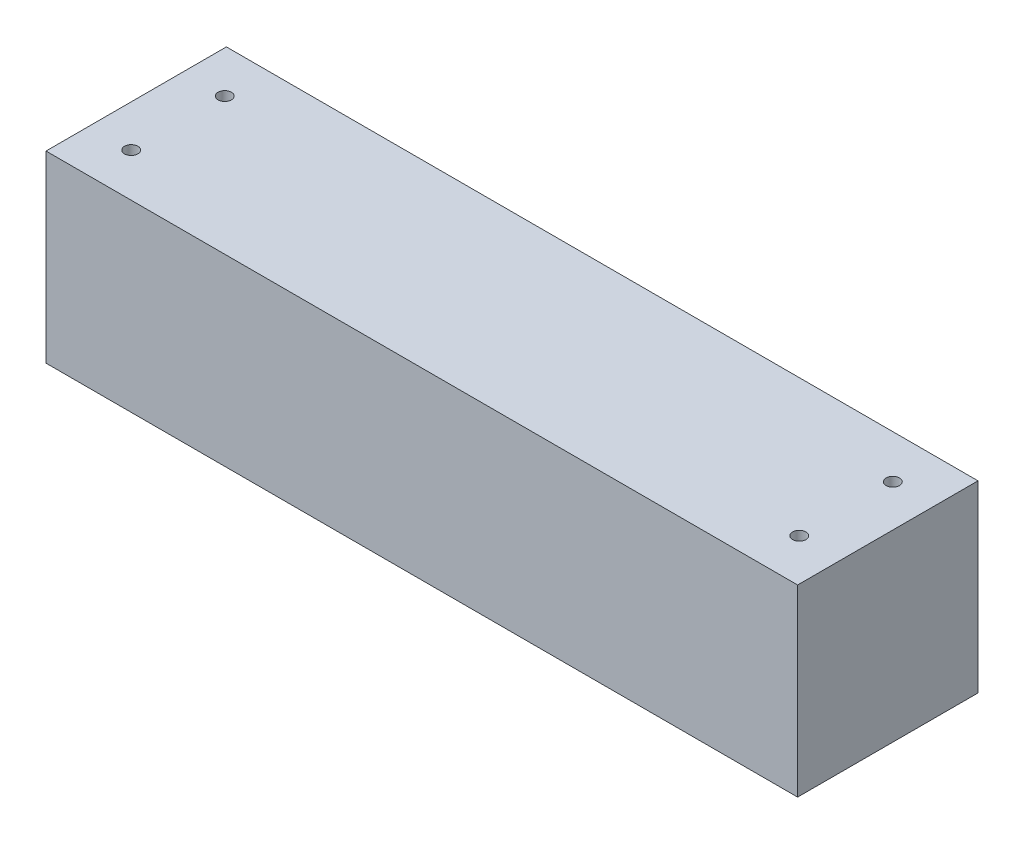
ISO-10303-21;
HEADER;
FILE_DESCRIPTION(('STEP AP214'),'2;1');
FILE_NAME('part.step','',(''),(''),'','','');
FILE_SCHEMA(('AUTOMOTIVE_DESIGN { 1 0 10303 214 1 1 1 1 }'));
ENDSEC;
DATA;
#1=APPLICATION_CONTEXT('core data for automotive mechanical design processes');
#2=APPLICATION_PROTOCOL_DEFINITION('international standard','automotive_design',2000,#1);
#3=PRODUCT_CONTEXT('',#1,'mechanical');
#4=PRODUCT('Part','Part','',(#3));
#5=PRODUCT_RELATED_PRODUCT_CATEGORY('part','',(#4));
#6=PRODUCT_DEFINITION_FORMATION('','',#4);
#7=PRODUCT_DEFINITION_CONTEXT('part definition',#1,'design');
#8=PRODUCT_DEFINITION('design','',#6,#7);
#9=PRODUCT_DEFINITION_SHAPE('','',#8);
#10=(LENGTH_UNIT() NAMED_UNIT(*) SI_UNIT(.MILLI.,.METRE.));
#11=(NAMED_UNIT(*) PLANE_ANGLE_UNIT() SI_UNIT($,.RADIAN.));
#12=(NAMED_UNIT(*) SI_UNIT($,.STERADIAN.) SOLID_ANGLE_UNIT());
#13=UNCERTAINTY_MEASURE_WITH_UNIT(LENGTH_MEASURE(1.E-05),#10,'distance_accuracy_value','');
#14=(GEOMETRIC_REPRESENTATION_CONTEXT(3) GLOBAL_UNCERTAINTY_ASSIGNED_CONTEXT((#13)) GLOBAL_UNIT_ASSIGNED_CONTEXT((#10,
#11,#12)) REPRESENTATION_CONTEXT('',''));
#15=CARTESIAN_POINT('',(0.,0.,0.));
#16=DIRECTION('',(0.,0.,1.));
#17=DIRECTION('',(1.,0.,0.));
#18=AXIS2_PLACEMENT_3D('',#15,#16,#17);
#19=CARTESIAN_POINT('',(0.,0.,54.));
#20=DIRECTION('',(1.,0.,0.));
#21=DIRECTION('',(0.,1.,0.));
#22=AXIS2_PLACEMENT_3D('',#19,#20,#21);
#23=PLANE('',#22);
#24=DIRECTION('',(0.,-1.,0.));
#25=VECTOR('',#24,1.);
#26=CARTESIAN_POINT('',(0.,0.,0.));
#27=LINE('',#26,#25);
#28=CARTESIAN_POINT('',(0.,0.,0.));
#29=VERTEX_POINT('',#28);
#30=CARTESIAN_POINT('',(0.,-55.,0.));
#31=VERTEX_POINT('',#30);
#32=EDGE_CURVE('E144',#29,#31,#27,.T.);
#33=ORIENTED_EDGE('',*,*,#32,.T.);
#34=DIRECTION('',(0.,0.,-1.));
#35=VECTOR('',#34,1.);
#36=CARTESIAN_POINT('',(0.,-55.,54.));
#37=LINE('',#36,#35);
#38=CARTESIAN_POINT('',(0.,-55.,54.));
#39=VERTEX_POINT('',#38);
#40=EDGE_CURVE('E11',#39,#31,#37,.T.);
#41=ORIENTED_EDGE('',*,*,#40,.F.);
#42=DIRECTION('',(0.,-1.,0.));
#43=VECTOR('',#42,1.);
#44=CARTESIAN_POINT('',(0.,0.,54.));
#45=LINE('',#44,#43);
#46=CARTESIAN_POINT('',(0.,0.,54.));
#47=VERTEX_POINT('',#46);
#48=EDGE_CURVE('E149',#47,#39,#45,.T.);
#49=ORIENTED_EDGE('',*,*,#48,.F.);
#50=DIRECTION('',(0.,0.,-1.));
#51=VECTOR('',#50,1.);
#52=CARTESIAN_POINT('',(0.,0.,54.));
#53=LINE('',#52,#51);
#54=EDGE_CURVE('E155',#47,#29,#53,.T.);
#55=ORIENTED_EDGE('',*,*,#54,.T.);
#56=EDGE_LOOP('',(#33,#41,#49,#55));
#57=FACE_BOUND('',#56,.T.);
#58=DIRECTION('',(0.,-1.,0.));
#59=VECTOR('',#58,1.);
#60=CARTESIAN_POINT('',(0.,0.,4.));
#61=LINE('',#60,#59);
#62=CARTESIAN_POINT('',(0.,-4.,4.));
#63=VERTEX_POINT('',#62);
#64=CARTESIAN_POINT('',(0.,-51.,4.));
#65=VERTEX_POINT('',#64);
#66=EDGE_CURVE('E115',#63,#65,#61,.T.);
#67=ORIENTED_EDGE('',*,*,#66,.F.);
#68=DIRECTION('',(0.,0.,-1.));
#69=VECTOR('',#68,1.);
#70=CARTESIAN_POINT('',(0.,-4.,54.));
#71=LINE('',#70,#69);
#72=CARTESIAN_POINT('',(0.,-4.,50.));
#73=VERTEX_POINT('',#72);
#74=EDGE_CURVE('E138',#73,#63,#71,.T.);
#75=ORIENTED_EDGE('',*,*,#74,.F.);
#76=DIRECTION('',(0.,-1.,0.));
#77=VECTOR('',#76,1.);
#78=CARTESIAN_POINT('',(0.,0.,50.));
#79=LINE('',#78,#77);
#80=CARTESIAN_POINT('',(0.,-51.,50.));
#81=VERTEX_POINT('',#80);
#82=EDGE_CURVE('E49',#73,#81,#79,.T.);
#83=ORIENTED_EDGE('',*,*,#82,.T.);
#84=DIRECTION('',(0.,0.,-1.));
#85=VECTOR('',#84,1.);
#86=CARTESIAN_POINT('',(0.,-51.,54.));
#87=LINE('',#86,#85);
#88=EDGE_CURVE('E126',#81,#65,#87,.T.);
#89=ORIENTED_EDGE('',*,*,#88,.T.);
#90=EDGE_LOOP('',(#67,#75,#83,#89));
#91=FACE_BOUND('',#90,.T.);
#92=ADVANCED_FACE('F33',(#57,#91),#23,.F.);
#93=CARTESIAN_POINT('',(0.,-55.,54.));
#94=DIRECTION('',(0.,1.,0.));
#95=DIRECTION('',(0.,0.,1.));
#96=AXIS2_PLACEMENT_3D('',#93,#94,#95);
#97=PLANE('',#96);
#98=DIRECTION('',(1.,0.,0.));
#99=VECTOR('',#98,1.);
#100=CARTESIAN_POINT('',(0.,-55.,0.));
#101=LINE('',#100,#99);
#102=CARTESIAN_POINT('',(225.,-55.,0.));
#103=VERTEX_POINT('',#102);
#104=EDGE_CURVE('E158',#31,#103,#101,.T.);
#105=ORIENTED_EDGE('',*,*,#104,.T.);
#106=DIRECTION('',(0.,0.,-1.));
#107=VECTOR('',#106,1.);
#108=CARTESIAN_POINT('',(225.,-55.,54.));
#109=LINE('',#108,#107);
#110=CARTESIAN_POINT('',(225.,-55.,54.));
#111=VERTEX_POINT('',#110);
#112=EDGE_CURVE('E41',#111,#103,#109,.T.);
#113=ORIENTED_EDGE('',*,*,#112,.F.);
#114=DIRECTION('',(1.,0.,0.));
#115=VECTOR('',#114,1.);
#116=CARTESIAN_POINT('',(0.,-55.,54.));
#117=LINE('',#116,#115);
#118=EDGE_CURVE('E86',#39,#111,#117,.T.);
#119=ORIENTED_EDGE('',*,*,#118,.F.);
#120=ORIENTED_EDGE('',*,*,#40,.T.);
#121=EDGE_LOOP('',(#105,#113,#119,#120));
#122=FACE_BOUND('',#121,.T.);
#123=ADVANCED_FACE('F197',(#122),#97,.F.);
#124=CARTESIAN_POINT('',(225.,0.,54.));
#125=DIRECTION('',(-1.,0.,0.));
#126=DIRECTION('',(0.,0.,1.));
#127=AXIS2_PLACEMENT_3D('',#124,#125,#126);
#128=PLANE('',#127);
#129=DIRECTION('',(0.,1.,0.));
#130=VECTOR('',#129,1.);
#131=CARTESIAN_POINT('',(225.,0.,0.));
#132=LINE('',#131,#130);
#133=CARTESIAN_POINT('',(225.,0.,0.));
#134=VERTEX_POINT('',#133);
#135=EDGE_CURVE('E160',#103,#134,#132,.T.);
#136=ORIENTED_EDGE('',*,*,#135,.T.);
#137=DIRECTION('',(0.,0.,-1.));
#138=VECTOR('',#137,1.);
#139=CARTESIAN_POINT('',(225.,0.,54.));
#140=LINE('',#139,#138);
#141=CARTESIAN_POINT('',(225.,0.,54.));
#142=VERTEX_POINT('',#141);
#143=EDGE_CURVE('E164',#142,#134,#140,.T.);
#144=ORIENTED_EDGE('',*,*,#143,.F.);
#145=DIRECTION('',(0.,1.,0.));
#146=VECTOR('',#145,1.);
#147=CARTESIAN_POINT('',(225.,0.,54.));
#148=LINE('',#147,#146);
#149=EDGE_CURVE('E152',#111,#142,#148,.T.);
#150=ORIENTED_EDGE('',*,*,#149,.F.);
#151=ORIENTED_EDGE('',*,*,#112,.T.);
#152=EDGE_LOOP('',(#136,#144,#150,#151));
#153=FACE_BOUND('',#152,.T.);
#154=ADVANCED_FACE('F202',(#153),#128,.F.);
#155=CARTESIAN_POINT('',(0.,0.,54.));
#156=DIRECTION('',(0.,-1.,0.));
#157=DIRECTION('',(0.,0.,-1.));
#158=AXIS2_PLACEMENT_3D('',#155,#156,#157);
#159=PLANE('',#158);
#160=CARTESIAN_POINT('',(12.5,0.,41.0019027549034));
#161=DIRECTION('',(0.,1.,0.));
#162=DIRECTION('',(0.,0.,-1.));
#163=AXIS2_PLACEMENT_3D('',#160,#161,#162);
#164=CIRCLE('',#163,2.);
#165=CARTESIAN_POINT('',(12.5,0.,39.0019027549034));
#166=VERTEX_POINT('',#165);
#167=EDGE_CURVE('E332',#166,#166,#164,.T.);
#168=ORIENTED_EDGE('',*,*,#167,.F.);
#169=EDGE_LOOP('',(#168));
#170=FACE_BOUND('',#169,.T.);
#171=CARTESIAN_POINT('',(212.5,0.,41.0019027549034));
#172=DIRECTION('',(0.,1.,0.));
#173=DIRECTION('',(0.,0.,1.));
#174=AXIS2_PLACEMENT_3D('',#171,#172,#173);
#175=CIRCLE('',#174,2.00000000000003);
#176=CARTESIAN_POINT('',(212.5,0.,43.0019027549034));
#177=VERTEX_POINT('',#176);
#178=EDGE_CURVE('E329',#177,#177,#175,.T.);
#179=ORIENTED_EDGE('',*,*,#178,.F.);
#180=EDGE_LOOP('',(#179));
#181=FACE_BOUND('',#180,.T.);
#182=CARTESIAN_POINT('',(212.5,0.,12.9980972450966));
#183=DIRECTION('',(0.,1.,0.));
#184=DIRECTION('',(0.,0.,-1.));
#185=AXIS2_PLACEMENT_3D('',#182,#183,#184);
#186=CIRCLE('',#185,2.00000000000003);
#187=CARTESIAN_POINT('',(212.5,0.,10.9980972450966));
#188=VERTEX_POINT('',#187);
#189=EDGE_CURVE('E331',#188,#188,#186,.T.);
#190=ORIENTED_EDGE('',*,*,#189,.F.);
#191=EDGE_LOOP('',(#190));
#192=FACE_BOUND('',#191,.T.);
#193=CARTESIAN_POINT('',(12.5,0.,12.9980972450966));
#194=DIRECTION('',(0.,1.,0.));
#195=DIRECTION('',(0.,0.,1.));
#196=AXIS2_PLACEMENT_3D('',#193,#194,#195);
#197=CIRCLE('',#196,2.);
#198=CARTESIAN_POINT('',(12.5,0.,14.9980972450966));
#199=VERTEX_POINT('',#198);
#200=EDGE_CURVE('E172',#199,#199,#197,.T.);
#201=ORIENTED_EDGE('',*,*,#200,.F.);
#202=EDGE_LOOP('',(#201));
#203=FACE_BOUND('',#202,.T.);
#204=DIRECTION('',(-1.,0.,0.));
#205=VECTOR('',#204,1.);
#206=CARTESIAN_POINT('',(0.,0.,0.));
#207=LINE('',#206,#205);
#208=EDGE_CURVE('E79',#134,#29,#207,.T.);
#209=ORIENTED_EDGE('',*,*,#208,.T.);
#210=ORIENTED_EDGE('',*,*,#54,.F.);
#211=DIRECTION('',(-1.,0.,0.));
#212=VECTOR('',#211,1.);
#213=CARTESIAN_POINT('',(0.,0.,54.));
#214=LINE('',#213,#212);
#215=EDGE_CURVE('E58',#142,#47,#214,.T.);
#216=ORIENTED_EDGE('',*,*,#215,.F.);
#217=ORIENTED_EDGE('',*,*,#143,.T.);
#218=EDGE_LOOP('',(#209,#210,#216,#217));
#219=FACE_BOUND('',#218,.T.);
#220=ADVANCED_FACE('F214',(#170,#181,#192,#203,#219),#159,.F.);
#221=CARTESIAN_POINT('',(0.,0.,54.));
#222=DIRECTION('',(0.,0.,1.));
#223=DIRECTION('',(1.,0.,0.));
#224=AXIS2_PLACEMENT_3D('',#221,#222,#223);
#225=PLANE('',#224);
#226=ORIENTED_EDGE('',*,*,#48,.T.);
#227=ORIENTED_EDGE('',*,*,#118,.T.);
#228=ORIENTED_EDGE('',*,*,#149,.T.);
#229=ORIENTED_EDGE('',*,*,#215,.T.);
#230=EDGE_LOOP('',(#226,#227,#228,#229));
#231=FACE_BOUND('',#230,.T.);
#232=ADVANCED_FACE('F212',(#231),#225,.T.);
#233=CARTESIAN_POINT('',(0.,0.,0.));
#234=DIRECTION('',(0.,0.,1.));
#235=DIRECTION('',(1.,0.,0.));
#236=AXIS2_PLACEMENT_3D('',#233,#234,#235);
#237=PLANE('',#236);
#238=ORIENTED_EDGE('',*,*,#32,.F.);
#239=ORIENTED_EDGE('',*,*,#208,.F.);
#240=ORIENTED_EDGE('',*,*,#135,.F.);
#241=ORIENTED_EDGE('',*,*,#104,.F.);
#242=EDGE_LOOP('',(#238,#239,#240,#241));
#243=FACE_BOUND('',#242,.T.);
#244=ADVANCED_FACE('F207',(#243),#237,.F.);
#245=CARTESIAN_POINT('',(0.,-51.,54.));
#246=DIRECTION('',(0.,1.,0.));
#247=DIRECTION('',(0.,0.,1.));
#248=AXIS2_PLACEMENT_3D('',#245,#246,#247);
#249=PLANE('',#248);
#250=DIRECTION('',(1.,0.,0.));
#251=VECTOR('',#250,1.);
#252=CARTESIAN_POINT('',(0.,-51.,4.));
#253=LINE('',#252,#251);
#254=CARTESIAN_POINT('',(221.,-51.,4.));
#255=VERTEX_POINT('',#254);
#256=EDGE_CURVE('E108',#65,#255,#253,.T.);
#257=ORIENTED_EDGE('',*,*,#256,.F.);
#258=ORIENTED_EDGE('',*,*,#88,.F.);
#259=DIRECTION('',(1.,0.,0.));
#260=VECTOR('',#259,1.);
#261=CARTESIAN_POINT('',(0.,-51.,50.));
#262=LINE('',#261,#260);
#263=CARTESIAN_POINT('',(221.,-51.,50.));
#264=VERTEX_POINT('',#263);
#265=EDGE_CURVE('E123',#81,#264,#262,.T.);
#266=ORIENTED_EDGE('',*,*,#265,.T.);
#267=DIRECTION('',(0.,0.,-1.));
#268=VECTOR('',#267,1.);
#269=CARTESIAN_POINT('',(221.,-51.,54.));
#270=LINE('',#269,#268);
#271=EDGE_CURVE('E121',#264,#255,#270,.T.);
#272=ORIENTED_EDGE('',*,*,#271,.T.);
#273=EDGE_LOOP('',(#257,#258,#266,#272));
#274=FACE_BOUND('',#273,.T.);
#275=ADVANCED_FACE('F122',(#274),#249,.T.);
#276=CARTESIAN_POINT('',(221.,0.,54.));
#277=DIRECTION('',(-1.,0.,0.));
#278=DIRECTION('',(0.,0.,1.));
#279=AXIS2_PLACEMENT_3D('',#276,#277,#278);
#280=PLANE('',#279);
#281=DIRECTION('',(0.,1.,0.));
#282=VECTOR('',#281,1.);
#283=CARTESIAN_POINT('',(221.,0.,4.));
#284=LINE('',#283,#282);
#285=CARTESIAN_POINT('',(221.,-4.,4.));
#286=VERTEX_POINT('',#285);
#287=EDGE_CURVE('E112',#255,#286,#284,.T.);
#288=ORIENTED_EDGE('',*,*,#287,.F.);
#289=ORIENTED_EDGE('',*,*,#271,.F.);
#290=DIRECTION('',(0.,1.,0.));
#291=VECTOR('',#290,1.);
#292=CARTESIAN_POINT('',(221.,0.,50.));
#293=LINE('',#292,#291);
#294=CARTESIAN_POINT('',(221.,-4.,50.));
#295=VERTEX_POINT('',#294);
#296=EDGE_CURVE('E139',#264,#295,#293,.T.);
#297=ORIENTED_EDGE('',*,*,#296,.T.);
#298=DIRECTION('',(0.,0.,-1.));
#299=VECTOR('',#298,1.);
#300=CARTESIAN_POINT('',(221.,-4.,54.));
#301=LINE('',#300,#299);
#302=EDGE_CURVE('E127',#295,#286,#301,.T.);
#303=ORIENTED_EDGE('',*,*,#302,.T.);
#304=EDGE_LOOP('',(#288,#289,#297,#303));
#305=FACE_BOUND('',#304,.T.);
#306=ADVANCED_FACE('F129',(#305),#280,.T.);
#307=CARTESIAN_POINT('',(0.,-4.,54.));
#308=DIRECTION('',(0.,-1.,0.));
#309=DIRECTION('',(0.,0.,-1.));
#310=AXIS2_PLACEMENT_3D('',#307,#308,#309);
#311=PLANE('',#310);
#312=CARTESIAN_POINT('',(12.5,-4.,41.0019027549034));
#313=DIRECTION('',(0.,-1.,0.));
#314=DIRECTION('',(0.,0.,-1.));
#315=AXIS2_PLACEMENT_3D('',#312,#313,#314);
#316=CIRCLE('',#315,2.);
#317=CARTESIAN_POINT('',(12.5,-4.,39.0019027549034));
#318=VERTEX_POINT('',#317);
#319=EDGE_CURVE('E36',#318,#318,#316,.T.);
#320=ORIENTED_EDGE('',*,*,#319,.F.);
#321=EDGE_LOOP('',(#320));
#322=FACE_BOUND('',#321,.T.);
#323=CARTESIAN_POINT('',(212.5,-4.,41.0019027549034));
#324=DIRECTION('',(0.,-1.,0.));
#325=DIRECTION('',(0.,0.,-1.));
#326=AXIS2_PLACEMENT_3D('',#323,#324,#325);
#327=CIRCLE('',#326,2.00000000000003);
#328=CARTESIAN_POINT('',(212.5,-4.,39.0019027549034));
#329=VERTEX_POINT('',#328);
#330=EDGE_CURVE('E174',#329,#329,#327,.T.);
#331=ORIENTED_EDGE('',*,*,#330,.F.);
#332=EDGE_LOOP('',(#331));
#333=FACE_BOUND('',#332,.T.);
#334=CARTESIAN_POINT('',(212.5,-4.,12.9980972450966));
#335=DIRECTION('',(0.,-1.,0.));
#336=DIRECTION('',(0.,0.,-1.));
#337=AXIS2_PLACEMENT_3D('',#334,#335,#336);
#338=CIRCLE('',#337,2.00000000000003);
#339=CARTESIAN_POINT('',(212.5,-4.,10.9980972450966));
#340=VERTEX_POINT('',#339);
#341=EDGE_CURVE('E171',#340,#340,#338,.T.);
#342=ORIENTED_EDGE('',*,*,#341,.F.);
#343=EDGE_LOOP('',(#342));
#344=FACE_BOUND('',#343,.T.);
#345=CARTESIAN_POINT('',(12.5,-4.,12.9980972450966));
#346=DIRECTION('',(0.,-1.,0.));
#347=DIRECTION('',(0.,0.,-1.));
#348=AXIS2_PLACEMENT_3D('',#345,#346,#347);
#349=CIRCLE('',#348,2.);
#350=CARTESIAN_POINT('',(12.5,-4.,10.9980972450966));
#351=VERTEX_POINT('',#350);
#352=EDGE_CURVE('E168',#351,#351,#349,.T.);
#353=ORIENTED_EDGE('',*,*,#352,.F.);
#354=EDGE_LOOP('',(#353));
#355=FACE_BOUND('',#354,.T.);
#356=DIRECTION('',(-1.,0.,0.));
#357=VECTOR('',#356,1.);
#358=CARTESIAN_POINT('',(0.,-4.,4.));
#359=LINE('',#358,#357);
#360=EDGE_CURVE('E132',#286,#63,#359,.T.);
#361=ORIENTED_EDGE('',*,*,#360,.F.);
#362=ORIENTED_EDGE('',*,*,#302,.F.);
#363=DIRECTION('',(-1.,0.,0.));
#364=VECTOR('',#363,1.);
#365=CARTESIAN_POINT('',(0.,-4.,50.));
#366=LINE('',#365,#364);
#367=EDGE_CURVE('E140',#295,#73,#366,.T.);
#368=ORIENTED_EDGE('',*,*,#367,.T.);
#369=ORIENTED_EDGE('',*,*,#74,.T.);
#370=EDGE_LOOP('',(#361,#362,#368,#369));
#371=FACE_BOUND('',#370,.T.);
#372=ADVANCED_FACE('F184',(#322,#333,#344,#355,#371),#311,.T.);
#373=CARTESIAN_POINT('',(0.,0.,50.));
#374=DIRECTION('',(0.,0.,1.));
#375=DIRECTION('',(1.,0.,0.));
#376=AXIS2_PLACEMENT_3D('',#373,#374,#375);
#377=PLANE('',#376);
#378=ORIENTED_EDGE('',*,*,#82,.F.);
#379=ORIENTED_EDGE('',*,*,#367,.F.);
#380=ORIENTED_EDGE('',*,*,#296,.F.);
#381=ORIENTED_EDGE('',*,*,#265,.F.);
#382=EDGE_LOOP('',(#378,#379,#380,#381));
#383=FACE_BOUND('',#382,.T.);
#384=ADVANCED_FACE('F187',(#383),#377,.F.);
#385=CARTESIAN_POINT('',(0.,0.,4.));
#386=DIRECTION('',(0.,0.,1.));
#387=DIRECTION('',(1.,0.,0.));
#388=AXIS2_PLACEMENT_3D('',#385,#386,#387);
#389=PLANE('',#388);
#390=ORIENTED_EDGE('',*,*,#66,.T.);
#391=ORIENTED_EDGE('',*,*,#256,.T.);
#392=ORIENTED_EDGE('',*,*,#287,.T.);
#393=ORIENTED_EDGE('',*,*,#360,.T.);
#394=EDGE_LOOP('',(#390,#391,#392,#393));
#395=FACE_BOUND('',#394,.T.);
#396=ADVANCED_FACE('F110',(#395),#389,.T.);
#397=CARTESIAN_POINT('',(12.5,-9.99999999999995,12.9980972450966));
#398=DIRECTION('',(0.,1.,0.));
#399=DIRECTION('',(0.,0.,1.));
#400=AXIS2_PLACEMENT_3D('',#397,#398,#399);
#401=CYLINDRICAL_SURFACE('',#400,2.);
#402=ORIENTED_EDGE('',*,*,#352,.T.);
#403=EDGE_LOOP('',(#402));
#404=FACE_BOUND('',#403,.T.);
#405=ORIENTED_EDGE('',*,*,#200,.T.);
#406=EDGE_LOOP('',(#405));
#407=FACE_BOUND('',#406,.T.);
#408=ADVANCED_FACE('F256',(#404,#407),#401,.F.);
#409=CARTESIAN_POINT('',(212.5,-9.99999999999995,12.9980972450966));
#410=DIRECTION('',(0.,1.,0.));
#411=DIRECTION('',(0.,0.,1.));
#412=AXIS2_PLACEMENT_3D('',#409,#410,#411);
#413=CYLINDRICAL_SURFACE('',#412,2.00000000000003);
#414=ORIENTED_EDGE('',*,*,#341,.T.);
#415=EDGE_LOOP('',(#414));
#416=FACE_BOUND('',#415,.T.);
#417=ORIENTED_EDGE('',*,*,#189,.T.);
#418=EDGE_LOOP('',(#417));
#419=FACE_BOUND('',#418,.T.);
#420=ADVANCED_FACE('F261',(#416,#419),#413,.F.);
#421=CARTESIAN_POINT('',(212.5,-9.99999999999995,41.0019027549034));
#422=DIRECTION('',(0.,1.,0.));
#423=DIRECTION('',(0.,0.,1.));
#424=AXIS2_PLACEMENT_3D('',#421,#422,#423);
#425=CYLINDRICAL_SURFACE('',#424,2.00000000000003);
#426=ORIENTED_EDGE('',*,*,#330,.T.);
#427=EDGE_LOOP('',(#426));
#428=FACE_BOUND('',#427,.T.);
#429=ORIENTED_EDGE('',*,*,#178,.T.);
#430=EDGE_LOOP('',(#429));
#431=FACE_BOUND('',#430,.T.);
#432=ADVANCED_FACE('F271',(#428,#431),#425,.F.);
#433=CARTESIAN_POINT('',(12.5,-9.99999999999995,41.0019027549034));
#434=DIRECTION('',(0.,1.,0.));
#435=DIRECTION('',(0.,0.,1.));
#436=AXIS2_PLACEMENT_3D('',#433,#434,#435);
#437=CYLINDRICAL_SURFACE('',#436,2.);
#438=ORIENTED_EDGE('',*,*,#319,.T.);
#439=EDGE_LOOP('',(#438));
#440=FACE_BOUND('',#439,.T.);
#441=ORIENTED_EDGE('',*,*,#167,.T.);
#442=EDGE_LOOP('',(#441));
#443=FACE_BOUND('',#442,.T.);
#444=ADVANCED_FACE('F181',(#440,#443),#437,.F.);
#445=CLOSED_SHELL('',(#92,#123,#154,#220,#232,#244,#275,#306,#372,#384,#396,#408,#420,#432,#444));
#446=MANIFOLD_SOLID_BREP('B2',#445);
#447=ADVANCED_BREP_SHAPE_REPRESENTATION('',(#18,#446),#14);
#448=SHAPE_DEFINITION_REPRESENTATION(#9,#447);
ENDSEC;
END-ISO-10303-21;
